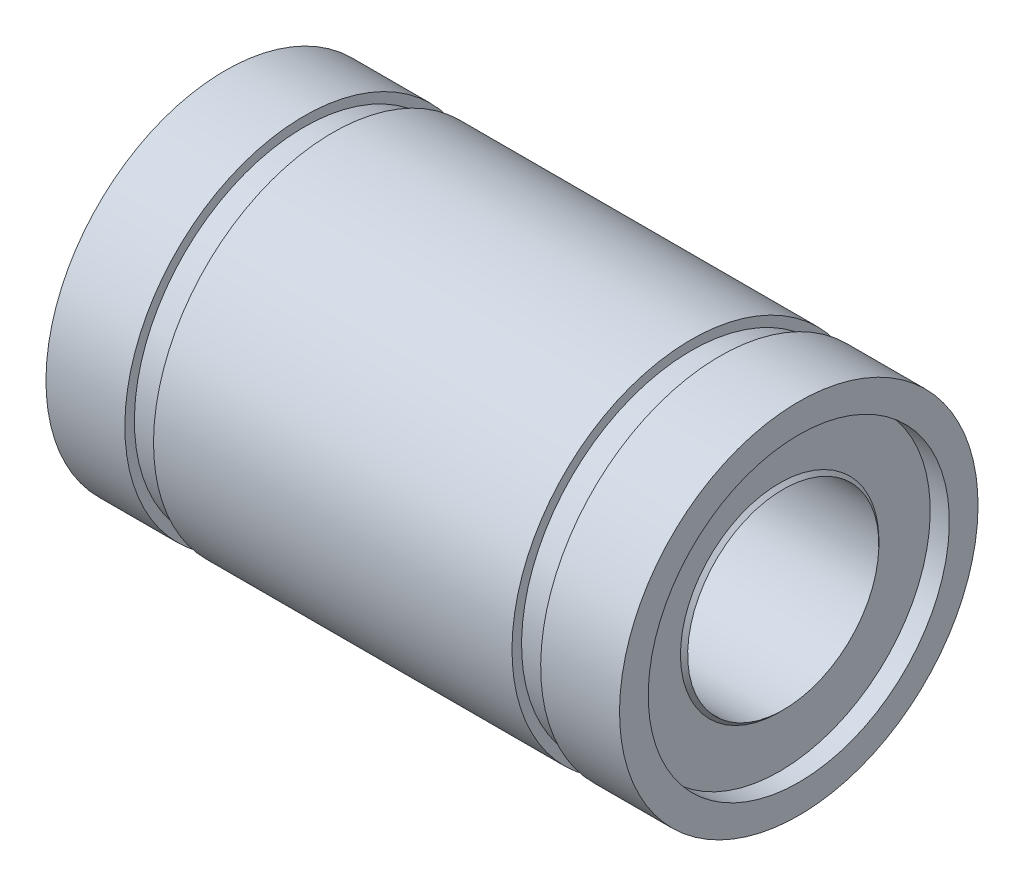
ISO-10303-21;
HEADER;
FILE_DESCRIPTION(('STEP AP214'),'2;1');
FILE_NAME('part.step','',(''),(''),'','','');
FILE_SCHEMA(('AUTOMOTIVE_DESIGN { 1 0 10303 214 1 1 1 1 }'));
ENDSEC;
DATA;
#1=APPLICATION_CONTEXT('core data for automotive mechanical design processes');
#2=APPLICATION_PROTOCOL_DEFINITION('international standard','automotive_design',2000,#1);
#3=PRODUCT_CONTEXT('',#1,'mechanical');
#4=PRODUCT('Part','Part','',(#3));
#5=PRODUCT_RELATED_PRODUCT_CATEGORY('part','',(#4));
#6=PRODUCT_DEFINITION_FORMATION('','',#4);
#7=PRODUCT_DEFINITION_CONTEXT('part definition',#1,'design');
#8=PRODUCT_DEFINITION('design','',#6,#7);
#9=PRODUCT_DEFINITION_SHAPE('','',#8);
#10=(LENGTH_UNIT() NAMED_UNIT(*) SI_UNIT(.MILLI.,.METRE.));
#11=(NAMED_UNIT(*) PLANE_ANGLE_UNIT() SI_UNIT($,.RADIAN.));
#12=(NAMED_UNIT(*) SI_UNIT($,.STERADIAN.) SOLID_ANGLE_UNIT());
#13=UNCERTAINTY_MEASURE_WITH_UNIT(LENGTH_MEASURE(1.E-05),#10,'distance_accuracy_value','');
#14=(GEOMETRIC_REPRESENTATION_CONTEXT(3) GLOBAL_UNCERTAINTY_ASSIGNED_CONTEXT((#13)) GLOBAL_UNIT_ASSIGNED_CONTEXT((#10,
#11,#12)) REPRESENTATION_CONTEXT('',''));
#15=CARTESIAN_POINT('',(0.,0.,0.));
#16=DIRECTION('',(0.,0.,1.));
#17=DIRECTION('',(1.,0.,0.));
#18=AXIS2_PLACEMENT_3D('',#15,#16,#17);
#19=CARTESIAN_POINT('',(-16.830555472771,-10.245239863841,5.674899117618));
#20=DIRECTION('',(1.,0.,0.));
#21=DIRECTION('',(0.,-0.982567445911182,-0.185906466362998));
#22=AXIS2_PLACEMENT_3D('',#19,#20,#21);
#23=CONICAL_SURFACE('',#22,4.075,0.785398163397448);
#24=CARTESIAN_POINT('',(-16.755555472771,-10.245239863841,5.674899117618));
#25=DIRECTION('',(1.,0.,0.));
#26=DIRECTION('',(0.,-0.185906466362998,0.982567445911182));
#27=AXIS2_PLACEMENT_3D('',#24,#25,#26);
#28=CIRCLE('',#27,4.15);
#29=CARTESIAN_POINT('',(-16.755555472771,-14.3228947643724,4.90338728221156));
#30=VERTEX_POINT('',#29);
#31=CARTESIAN_POINT('',(-16.755555472771,-6.16758496330959,6.44641095302444));
#32=VERTEX_POINT('',#31);
#33=EDGE_CURVE('E41',#30,#32,#28,.T.);
#34=ORIENTED_EDGE('',*,*,#33,.F.);
#35=CARTESIAN_POINT('',(-16.755555472771,-10.245239863841,5.674899117618));
#36=DIRECTION('',(1.,0.,0.));
#37=DIRECTION('',(0.,-0.185906466362998,0.982567445911182));
#38=AXIS2_PLACEMENT_3D('',#35,#36,#37);
#39=CIRCLE('',#38,4.15);
#40=EDGE_CURVE('E206',#32,#30,#39,.T.);
#41=ORIENTED_EDGE('',*,*,#40,.F.);
#42=DIRECTION('',(-0.707106781186547,-0.694780103976944,-0.131455723031705));
#43=VECTOR('',#42,1.);
#44=CARTESIAN_POINT('',(-16.830555472771,-6.24127752175293,6.43246796804722));
#45=LINE('',#44,#43);
#46=CARTESIAN_POINT('',(-16.905555472771,-6.31497008019627,6.41852498306999));
#47=VERTEX_POINT('',#46);
#48=EDGE_CURVE('E11',#32,#47,#45,.T.);
#49=ORIENTED_EDGE('',*,*,#48,.T.);
#50=CARTESIAN_POINT('',(-16.905555472771,-10.245239863841,5.674899117618));
#51=DIRECTION('',(1.,0.,0.));
#52=DIRECTION('',(0.,-0.185906466362998,0.982567445911182));
#53=AXIS2_PLACEMENT_3D('',#50,#51,#52);
#54=CIRCLE('',#53,4.);
#55=CARTESIAN_POINT('',(-16.905555472771,-14.1755096474857,4.93127325216601));
#56=VERTEX_POINT('',#55);
#57=EDGE_CURVE('E27',#47,#56,#54,.T.);
#58=ORIENTED_EDGE('',*,*,#57,.T.);
#59=CARTESIAN_POINT('',(-16.905555472771,-10.245239863841,5.674899117618));
#60=DIRECTION('',(1.,0.,0.));
#61=DIRECTION('',(0.,-0.185906466362998,0.982567445911182));
#62=AXIS2_PLACEMENT_3D('',#59,#60,#61);
#63=CIRCLE('',#62,4.);
#64=EDGE_CURVE('E205',#56,#47,#63,.T.);
#65=ORIENTED_EDGE('',*,*,#64,.T.);
#66=ORIENTED_EDGE('',*,*,#48,.F.);
#67=EDGE_LOOP('',(#34,#41,#49,#58,#65,#66));
#68=FACE_BOUND('',#67,.T.);
#69=ADVANCED_FACE('F16',(#68),#23,.T.);
#70=CARTESIAN_POINT('',(-16.755555472771,-16.4354147730814,4.50368837953111));
#71=DIRECTION('',(-1.,0.,0.));
#72=DIRECTION('',(0.,0.185906466362998,-0.982567445911182));
#73=AXIS2_PLACEMENT_3D('',#70,#71,#72);
#74=PLANE('',#73);
#75=CARTESIAN_POINT('',(-16.755555472771,-10.245239863841,5.674899117618));
#76=DIRECTION('',(1.,0.,0.));
#77=DIRECTION('',(0.,-0.185906466362998,0.982567445911182));
#78=AXIS2_PLACEMENT_3D('',#75,#76,#77);
#79=CIRCLE('',#78,6.3);
#80=CARTESIAN_POINT('',(-16.755555472771,-16.4354147730814,4.50368837953111));
#81=VERTEX_POINT('',#80);
#82=CARTESIAN_POINT('',(-16.755555472771,-4.05506495460056,6.84610985570489));
#83=VERTEX_POINT('',#82);
#84=EDGE_CURVE('E288',#81,#83,#79,.T.);
#85=ORIENTED_EDGE('',*,*,#84,.F.);
#86=CARTESIAN_POINT('',(-16.755555472771,-10.245239863841,5.674899117618));
#87=DIRECTION('',(1.,0.,0.));
#88=DIRECTION('',(0.,-0.185906466362998,0.982567445911182));
#89=AXIS2_PLACEMENT_3D('',#86,#87,#88);
#90=CIRCLE('',#89,6.3);
#91=EDGE_CURVE('E238',#83,#81,#90,.T.);
#92=ORIENTED_EDGE('',*,*,#91,.F.);
#93=EDGE_LOOP('',(#85,#92));
#94=FACE_BOUND('',#93,.T.);
#95=ORIENTED_EDGE('',*,*,#33,.T.);
#96=ORIENTED_EDGE('',*,*,#40,.T.);
#97=EDGE_LOOP('',(#95,#96));
#98=FACE_BOUND('',#97,.T.);
#99=ADVANCED_FACE('F366',(#94,#98),#74,.T.);
#100=CARTESIAN_POINT('',(-17.155555472771,-10.245239863841,5.674899117618));
#101=DIRECTION('',(1.,0.,0.));
#102=DIRECTION('',(0.,-0.982567445911182,-0.185906466362998));
#103=AXIS2_PLACEMENT_3D('',#100,#101,#102);
#104=CYLINDRICAL_SURFACE('',#103,6.3);
#105=ORIENTED_EDGE('',*,*,#84,.T.);
#106=DIRECTION('',(-1.,0.,0.));
#107=VECTOR('',#106,1.);
#108=CARTESIAN_POINT('',(-17.155555472771,-4.05506495460056,6.84610985570489));
#109=LINE('',#108,#107);
#110=CARTESIAN_POINT('',(-17.555555472771,-4.05506495460056,6.84610985570489));
#111=VERTEX_POINT('',#110);
#112=EDGE_CURVE('E242',#83,#111,#109,.T.);
#113=ORIENTED_EDGE('',*,*,#112,.T.);
#114=CARTESIAN_POINT('',(-17.555555472771,-10.245239863841,5.674899117618));
#115=DIRECTION('',(1.,0.,0.));
#116=DIRECTION('',(0.,-0.185906466362998,0.982567445911182));
#117=AXIS2_PLACEMENT_3D('',#114,#115,#116);
#118=CIRCLE('',#117,6.3);
#119=CARTESIAN_POINT('',(-17.555555472771,-16.4354147730814,4.50368837953111));
#120=VERTEX_POINT('',#119);
#121=EDGE_CURVE('E199',#120,#111,#118,.T.);
#122=ORIENTED_EDGE('',*,*,#121,.F.);
#123=CARTESIAN_POINT('',(-17.555555472771,-10.245239863841,5.674899117618));
#124=DIRECTION('',(1.,0.,0.));
#125=DIRECTION('',(0.,-0.185906466362998,0.982567445911182));
#126=AXIS2_PLACEMENT_3D('',#123,#124,#125);
#127=CIRCLE('',#126,6.3);
#128=EDGE_CURVE('E192',#111,#120,#127,.T.);
#129=ORIENTED_EDGE('',*,*,#128,.F.);
#130=ORIENTED_EDGE('',*,*,#112,.F.);
#131=ORIENTED_EDGE('',*,*,#91,.T.);
#132=EDGE_LOOP('',(#105,#113,#122,#129,#130,#131));
#133=FACE_BOUND('',#132,.T.);
#134=ADVANCED_FACE('F370',(#133),#104,.F.);
#135=CARTESIAN_POINT('',(-17.555555472771,-17.6144957081749,4.28060061989552));
#136=DIRECTION('',(-1.,0.,0.));
#137=DIRECTION('',(0.,0.185906466362998,-0.982567445911182));
#138=AXIS2_PLACEMENT_3D('',#135,#136,#137);
#139=PLANE('',#138);
#140=CARTESIAN_POINT('',(-17.555555472771,-10.245239863841,5.674899117618));
#141=DIRECTION('',(1.,0.,0.));
#142=DIRECTION('',(0.,-0.185906466362998,0.982567445911182));
#143=AXIS2_PLACEMENT_3D('',#140,#141,#142);
#144=CIRCLE('',#143,7.5);
#145=CARTESIAN_POINT('',(-17.555555472771,-17.6144957081749,4.28060061989552));
#146=VERTEX_POINT('',#145);
#147=CARTESIAN_POINT('',(-17.555555472771,-2.87598401950713,7.06919761534049));
#148=VERTEX_POINT('',#147);
#149=EDGE_CURVE('E20',#146,#148,#144,.T.);
#150=ORIENTED_EDGE('',*,*,#149,.F.);
#151=CARTESIAN_POINT('',(-17.555555472771,-10.245239863841,5.674899117618));
#152=DIRECTION('',(1.,0.,0.));
#153=DIRECTION('',(0.,-0.185906466362998,0.982567445911182));
#154=AXIS2_PLACEMENT_3D('',#151,#152,#153);
#155=CIRCLE('',#154,7.5);
#156=EDGE_CURVE('E180',#148,#146,#155,.T.);
#157=ORIENTED_EDGE('',*,*,#156,.F.);
#158=EDGE_LOOP('',(#150,#157));
#159=FACE_BOUND('',#158,.T.);
#160=ORIENTED_EDGE('',*,*,#121,.T.);
#161=ORIENTED_EDGE('',*,*,#128,.T.);
#162=EDGE_LOOP('',(#160,#161));
#163=FACE_BOUND('',#162,.T.);
#164=ADVANCED_FACE('F184',(#159,#163),#139,.T.);
#165=CARTESIAN_POINT('',(-15.905555472771,-10.245239863841,5.674899117618));
#166=DIRECTION('',(1.,0.,0.));
#167=DIRECTION('',(0.,-0.982567445911182,-0.185906466362998));
#168=AXIS2_PLACEMENT_3D('',#165,#166,#167);
#169=CYLINDRICAL_SURFACE('',#168,7.5);
#170=CARTESIAN_POINT('',(-14.255555472771,-10.245239863841,5.674899117618));
#171=DIRECTION('',(1.,0.,0.));
#172=DIRECTION('',(0.,-0.185906466362998,0.982567445911182));
#173=AXIS2_PLACEMENT_3D('',#170,#171,#172);
#174=CIRCLE('',#173,7.5);
#175=CARTESIAN_POINT('',(-14.255555472771,-17.6144957081749,4.28060061989552));
#176=VERTEX_POINT('',#175);
#177=CARTESIAN_POINT('',(-14.255555472771,-2.87598401950713,7.06919761534049));
#178=VERTEX_POINT('',#177);
#179=EDGE_CURVE('E183',#176,#178,#174,.T.);
#180=ORIENTED_EDGE('',*,*,#179,.F.);
#181=CARTESIAN_POINT('',(-14.255555472771,-10.245239863841,5.674899117618));
#182=DIRECTION('',(1.,0.,0.));
#183=DIRECTION('',(0.,-0.185906466362998,0.982567445911182));
#184=AXIS2_PLACEMENT_3D('',#181,#182,#183);
#185=CIRCLE('',#184,7.5);
#186=EDGE_CURVE('E189',#178,#176,#185,.T.);
#187=ORIENTED_EDGE('',*,*,#186,.F.);
#188=DIRECTION('',(-1.,0.,0.));
#189=VECTOR('',#188,1.);
#190=CARTESIAN_POINT('',(-15.905555472771,-2.87598401950713,7.06919761534049));
#191=LINE('',#190,#189);
#192=EDGE_CURVE('E179',#178,#148,#191,.T.);
#193=ORIENTED_EDGE('',*,*,#192,.T.);
#194=ORIENTED_EDGE('',*,*,#156,.T.);
#195=ORIENTED_EDGE('',*,*,#149,.T.);
#196=ORIENTED_EDGE('',*,*,#192,.F.);
#197=EDGE_LOOP('',(#180,#187,#193,#194,#195,#196));
#198=FACE_BOUND('',#197,.T.);
#199=ADVANCED_FACE('F177',(#198),#169,.T.);
#200=CARTESIAN_POINT('',(-14.255555472771,-17.2214687298104,4.35496320644071));
#201=DIRECTION('',(1.,0.,0.));
#202=DIRECTION('',(0.,-0.982567445911182,-0.185906466362998));
#203=AXIS2_PLACEMENT_3D('',#200,#201,#202);
#204=PLANE('',#203);
#205=ORIENTED_EDGE('',*,*,#179,.T.);
#206=ORIENTED_EDGE('',*,*,#186,.T.);
#207=EDGE_LOOP('',(#205,#206));
#208=FACE_BOUND('',#207,.T.);
#209=CARTESIAN_POINT('',(-14.255555472771,-10.245239863841,5.674899117618));
#210=DIRECTION('',(1.,0.,0.));
#211=DIRECTION('',(0.,-0.185906466362998,0.982567445911182));
#212=AXIS2_PLACEMENT_3D('',#209,#210,#211);
#213=CIRCLE('',#212,7.1);
#214=CARTESIAN_POINT('',(-14.255555472771,-17.2214687298104,4.35496320644071));
#215=VERTEX_POINT('',#214);
#216=CARTESIAN_POINT('',(-14.255555472771,-3.26901099787161,6.99483502879529));
#217=VERTEX_POINT('',#216);
#218=EDGE_CURVE('E229',#215,#217,#213,.T.);
#219=ORIENTED_EDGE('',*,*,#218,.F.);
#220=CARTESIAN_POINT('',(-14.255555472771,-10.245239863841,5.674899117618));
#221=DIRECTION('',(1.,0.,0.));
#222=DIRECTION('',(0.,-0.185906466362998,0.982567445911182));
#223=AXIS2_PLACEMENT_3D('',#220,#221,#222);
#224=CIRCLE('',#223,7.1);
#225=EDGE_CURVE('E231',#217,#215,#224,.T.);
#226=ORIENTED_EDGE('',*,*,#225,.F.);
#227=EDGE_LOOP('',(#219,#226));
#228=FACE_BOUND('',#227,.T.);
#229=ADVANCED_FACE('F352',(#208,#228),#204,.T.);
#230=CARTESIAN_POINT('',(-13.655555472771,-10.245239863841,5.674899117618));
#231=DIRECTION('',(1.,0.,0.));
#232=DIRECTION('',(0.,-0.982567445911182,-0.185906466362998));
#233=AXIS2_PLACEMENT_3D('',#230,#231,#232);
#234=CYLINDRICAL_SURFACE('',#233,7.1);
#235=CARTESIAN_POINT('',(-13.055555472771,-10.245239863841,5.674899117618));
#236=DIRECTION('',(1.,0.,0.));
#237=DIRECTION('',(0.,-0.185906466362998,0.982567445911182));
#238=AXIS2_PLACEMENT_3D('',#235,#236,#237);
#239=CIRCLE('',#238,7.1);
#240=CARTESIAN_POINT('',(-13.055555472771,-17.2214687298104,4.35496320644071));
#241=VERTEX_POINT('',#240);
#242=CARTESIAN_POINT('',(-13.055555472771,-3.26901099787161,6.99483502879529));
#243=VERTEX_POINT('',#242);
#244=EDGE_CURVE('E232',#241,#243,#239,.T.);
#245=ORIENTED_EDGE('',*,*,#244,.F.);
#246=CARTESIAN_POINT('',(-13.055555472771,-10.245239863841,5.674899117618));
#247=DIRECTION('',(1.,0.,0.));
#248=DIRECTION('',(0.,-0.185906466362998,0.982567445911182));
#249=AXIS2_PLACEMENT_3D('',#246,#247,#248);
#250=CIRCLE('',#249,7.1);
#251=EDGE_CURVE('E285',#243,#241,#250,.T.);
#252=ORIENTED_EDGE('',*,*,#251,.F.);
#253=DIRECTION('',(-1.,0.,0.));
#254=VECTOR('',#253,1.);
#255=CARTESIAN_POINT('',(-13.655555472771,-3.26901099787161,6.99483502879529));
#256=LINE('',#255,#254);
#257=EDGE_CURVE('E279',#243,#217,#256,.T.);
#258=ORIENTED_EDGE('',*,*,#257,.T.);
#259=ORIENTED_EDGE('',*,*,#225,.T.);
#260=ORIENTED_EDGE('',*,*,#218,.T.);
#261=ORIENTED_EDGE('',*,*,#257,.F.);
#262=EDGE_LOOP('',(#245,#252,#258,#259,#260,#261));
#263=FACE_BOUND('',#262,.T.);
#264=ADVANCED_FACE('F344',(#263),#234,.T.);
#265=CARTESIAN_POINT('',(-13.055555472771,-17.6144957081749,4.28060061989552));
#266=DIRECTION('',(-1.,0.,0.));
#267=DIRECTION('',(0.,0.185906466362998,-0.982567445911182));
#268=AXIS2_PLACEMENT_3D('',#265,#266,#267);
#269=PLANE('',#268);
#270=CARTESIAN_POINT('',(-13.055555472771,-10.245239863841,5.674899117618));
#271=DIRECTION('',(1.,0.,0.));
#272=DIRECTION('',(0.,-0.185906466362998,0.982567445911182));
#273=AXIS2_PLACEMENT_3D('',#270,#271,#272);
#274=CIRCLE('',#273,7.5);
#275=CARTESIAN_POINT('',(-13.055555472771,-17.6144957081749,4.28060061989552));
#276=VERTEX_POINT('',#275);
#277=CARTESIAN_POINT('',(-13.055555472771,-2.87598401950713,7.06919761534049));
#278=VERTEX_POINT('',#277);
#279=EDGE_CURVE('E271',#276,#278,#274,.T.);
#280=ORIENTED_EDGE('',*,*,#279,.F.);
#281=CARTESIAN_POINT('',(-13.055555472771,-10.245239863841,5.674899117618));
#282=DIRECTION('',(1.,0.,0.));
#283=DIRECTION('',(0.,-0.185906466362998,0.982567445911182));
#284=AXIS2_PLACEMENT_3D('',#281,#282,#283);
#285=CIRCLE('',#284,7.5);
#286=EDGE_CURVE('E274',#278,#276,#285,.T.);
#287=ORIENTED_EDGE('',*,*,#286,.F.);
#288=EDGE_LOOP('',(#280,#287));
#289=FACE_BOUND('',#288,.T.);
#290=ORIENTED_EDGE('',*,*,#244,.T.);
#291=ORIENTED_EDGE('',*,*,#251,.T.);
#292=EDGE_LOOP('',(#290,#291));
#293=FACE_BOUND('',#292,.T.);
#294=ADVANCED_FACE('F341',(#289,#293),#269,.T.);
#295=CARTESIAN_POINT('',(-5.555555472771,-10.245239863841,5.674899117618));
#296=DIRECTION('',(1.,0.,0.));
#297=DIRECTION('',(0.,-0.982567445911182,-0.185906466362998));
#298=AXIS2_PLACEMENT_3D('',#295,#296,#297);
#299=CYLINDRICAL_SURFACE('',#298,7.5);
#300=CARTESIAN_POINT('',(1.944444527229,-10.245239863841,5.674899117618));
#301=DIRECTION('',(1.,0.,0.));
#302=DIRECTION('',(0.,-0.185906466362998,0.982567445911182));
#303=AXIS2_PLACEMENT_3D('',#300,#301,#302);
#304=CIRCLE('',#303,7.5);
#305=CARTESIAN_POINT('',(1.944444527229,-17.6144957081749,4.28060061989552));
#306=VERTEX_POINT('',#305);
#307=CARTESIAN_POINT('',(1.944444527229,-2.87598401950711,7.06919761534049));
#308=VERTEX_POINT('',#307);
#309=EDGE_CURVE('E275',#306,#308,#304,.T.);
#310=ORIENTED_EDGE('',*,*,#309,.F.);
#311=CARTESIAN_POINT('',(1.944444527229,-10.245239863841,5.674899117618));
#312=DIRECTION('',(1.,0.,0.));
#313=DIRECTION('',(0.,-0.185906466362998,0.982567445911182));
#314=AXIS2_PLACEMENT_3D('',#311,#312,#313);
#315=CIRCLE('',#314,7.5);
#316=EDGE_CURVE('E297',#308,#306,#315,.T.);
#317=ORIENTED_EDGE('',*,*,#316,.F.);
#318=DIRECTION('',(-1.,0.,0.));
#319=VECTOR('',#318,1.);
#320=CARTESIAN_POINT('',(-5.55555547277101,-2.87598401950713,7.06919761534049));
#321=LINE('',#320,#319);
#322=EDGE_CURVE('E312',#308,#278,#321,.T.);
#323=ORIENTED_EDGE('',*,*,#322,.T.);
#324=ORIENTED_EDGE('',*,*,#286,.T.);
#325=ORIENTED_EDGE('',*,*,#279,.T.);
#326=ORIENTED_EDGE('',*,*,#322,.F.);
#327=EDGE_LOOP('',(#310,#317,#323,#324,#325,#326));
#328=FACE_BOUND('',#327,.T.);
#329=ADVANCED_FACE('F338',(#328),#299,.T.);
#330=CARTESIAN_POINT('',(1.944444527229,-17.2214687298104,4.35496320644071));
#331=DIRECTION('',(1.,0.,0.));
#332=DIRECTION('',(0.,-0.982567445911182,-0.185906466362998));
#333=AXIS2_PLACEMENT_3D('',#330,#331,#332);
#334=PLANE('',#333);
#335=ORIENTED_EDGE('',*,*,#309,.T.);
#336=ORIENTED_EDGE('',*,*,#316,.T.);
#337=EDGE_LOOP('',(#335,#336));
#338=FACE_BOUND('',#337,.T.);
#339=CARTESIAN_POINT('',(1.944444527229,-10.245239863841,5.674899117618));
#340=DIRECTION('',(1.,0.,0.));
#341=DIRECTION('',(0.,-0.185906466362998,0.982567445911182));
#342=AXIS2_PLACEMENT_3D('',#339,#340,#341);
#343=CIRCLE('',#342,7.1);
#344=CARTESIAN_POINT('',(1.944444527229,-17.2214687298104,4.35496320644071));
#345=VERTEX_POINT('',#344);
#346=CARTESIAN_POINT('',(1.944444527229,-3.26901099787159,6.99483502879529));
#347=VERTEX_POINT('',#346);
#348=EDGE_CURVE('E226',#345,#347,#343,.T.);
#349=ORIENTED_EDGE('',*,*,#348,.F.);
#350=CARTESIAN_POINT('',(1.944444527229,-10.245239863841,5.674899117618));
#351=DIRECTION('',(1.,0.,0.));
#352=DIRECTION('',(0.,-0.185906466362998,0.982567445911182));
#353=AXIS2_PLACEMENT_3D('',#350,#351,#352);
#354=CIRCLE('',#353,7.1);
#355=EDGE_CURVE('E221',#347,#345,#354,.T.);
#356=ORIENTED_EDGE('',*,*,#355,.F.);
#357=EDGE_LOOP('',(#349,#356));
#358=FACE_BOUND('',#357,.T.);
#359=ADVANCED_FACE('F382',(#338,#358),#334,.T.);
#360=CARTESIAN_POINT('',(2.544444527229,-10.245239863841,5.674899117618));
#361=DIRECTION('',(1.,0.,0.));
#362=DIRECTION('',(0.,-0.982567445911182,-0.185906466362998));
#363=AXIS2_PLACEMENT_3D('',#360,#361,#362);
#364=CYLINDRICAL_SURFACE('',#363,7.1);
#365=CARTESIAN_POINT('',(3.144444527229,-10.245239863841,5.674899117618));
#366=DIRECTION('',(1.,0.,0.));
#367=DIRECTION('',(0.,-0.185906466362998,0.982567445911182));
#368=AXIS2_PLACEMENT_3D('',#365,#366,#367);
#369=CIRCLE('',#368,7.1);
#370=CARTESIAN_POINT('',(3.144444527229,-17.2214687298104,4.35496320644071));
#371=VERTEX_POINT('',#370);
#372=CARTESIAN_POINT('',(3.144444527229,-3.26901099787159,6.99483502879529));
#373=VERTEX_POINT('',#372);
#374=EDGE_CURVE('E234',#371,#373,#369,.T.);
#375=ORIENTED_EDGE('',*,*,#374,.F.);
#376=CARTESIAN_POINT('',(3.144444527229,-10.245239863841,5.674899117618));
#377=DIRECTION('',(1.,0.,0.));
#378=DIRECTION('',(0.,-0.185906466362998,0.982567445911182));
#379=AXIS2_PLACEMENT_3D('',#376,#377,#378);
#380=CIRCLE('',#379,7.1);
#381=EDGE_CURVE('E213',#373,#371,#380,.T.);
#382=ORIENTED_EDGE('',*,*,#381,.F.);
#383=DIRECTION('',(-1.,0.,0.));
#384=VECTOR('',#383,1.);
#385=CARTESIAN_POINT('',(2.544444527229,-3.26901099787159,6.99483502879529));
#386=LINE('',#385,#384);
#387=EDGE_CURVE('E225',#373,#347,#386,.T.);
#388=ORIENTED_EDGE('',*,*,#387,.T.);
#389=ORIENTED_EDGE('',*,*,#355,.T.);
#390=ORIENTED_EDGE('',*,*,#348,.T.);
#391=ORIENTED_EDGE('',*,*,#387,.F.);
#392=EDGE_LOOP('',(#375,#382,#388,#389,#390,#391));
#393=FACE_BOUND('',#392,.T.);
#394=ADVANCED_FACE('F386',(#393),#364,.T.);
#395=CARTESIAN_POINT('',(3.144444527229,-17.6144957081749,4.28060061989552));
#396=DIRECTION('',(-1.,0.,0.));
#397=DIRECTION('',(0.,0.185906466362998,-0.982567445911182));
#398=AXIS2_PLACEMENT_3D('',#395,#396,#397);
#399=PLANE('',#398);
#400=CARTESIAN_POINT('',(3.144444527229,-10.245239863841,5.674899117618));
#401=DIRECTION('',(1.,0.,0.));
#402=DIRECTION('',(0.,-0.185906466362998,0.982567445911182));
#403=AXIS2_PLACEMENT_3D('',#400,#401,#402);
#404=CIRCLE('',#403,7.5);
#405=CARTESIAN_POINT('',(3.144444527229,-17.6144957081749,4.28060061989552));
#406=VERTEX_POINT('',#405);
#407=CARTESIAN_POINT('',(3.144444527229,-2.87598401950711,7.06919761534049));
#408=VERTEX_POINT('',#407);
#409=EDGE_CURVE('E269',#406,#408,#404,.T.);
#410=ORIENTED_EDGE('',*,*,#409,.F.);
#411=CARTESIAN_POINT('',(3.144444527229,-10.245239863841,5.674899117618));
#412=DIRECTION('',(1.,0.,0.));
#413=DIRECTION('',(0.,-0.185906466362998,0.982567445911182));
#414=AXIS2_PLACEMENT_3D('',#411,#412,#413);
#415=CIRCLE('',#414,7.5);
#416=EDGE_CURVE('E214',#408,#406,#415,.T.);
#417=ORIENTED_EDGE('',*,*,#416,.F.);
#418=EDGE_LOOP('',(#410,#417));
#419=FACE_BOUND('',#418,.T.);
#420=ORIENTED_EDGE('',*,*,#374,.T.);
#421=ORIENTED_EDGE('',*,*,#381,.T.);
#422=EDGE_LOOP('',(#420,#421));
#423=FACE_BOUND('',#422,.T.);
#424=ADVANCED_FACE('F388',(#419,#423),#399,.T.);
#425=CARTESIAN_POINT('',(4.794444527229,-10.245239863841,5.674899117618));
#426=DIRECTION('',(1.,0.,0.));
#427=DIRECTION('',(0.,-0.982567445911182,-0.185906466362998));
#428=AXIS2_PLACEMENT_3D('',#425,#426,#427);
#429=CYLINDRICAL_SURFACE('',#428,7.5);
#430=CARTESIAN_POINT('',(6.444444527229,-10.245239863841,5.674899117618));
#431=DIRECTION('',(1.,0.,0.));
#432=DIRECTION('',(0.,-0.185906466362998,0.982567445911182));
#433=AXIS2_PLACEMENT_3D('',#430,#431,#432);
#434=CIRCLE('',#433,7.5);
#435=CARTESIAN_POINT('',(6.44444452722901,-17.6144957081749,4.28060061989552));
#436=VERTEX_POINT('',#435);
#437=CARTESIAN_POINT('',(6.44444452722899,-2.87598401950711,7.06919761534049));
#438=VERTEX_POINT('',#437);
#439=EDGE_CURVE('E265',#436,#438,#434,.T.);
#440=ORIENTED_EDGE('',*,*,#439,.F.);
#441=CARTESIAN_POINT('',(6.444444527229,-10.245239863841,5.674899117618));
#442=DIRECTION('',(1.,0.,0.));
#443=DIRECTION('',(0.,-0.185906466362998,0.982567445911182));
#444=AXIS2_PLACEMENT_3D('',#441,#442,#443);
#445=CIRCLE('',#444,7.5);
#446=EDGE_CURVE('E270',#438,#436,#445,.T.);
#447=ORIENTED_EDGE('',*,*,#446,.F.);
#448=DIRECTION('',(-1.,0.,0.));
#449=VECTOR('',#448,1.);
#450=CARTESIAN_POINT('',(4.79444452722899,-2.87598401950711,7.06919761534049));
#451=LINE('',#450,#449);
#452=EDGE_CURVE('E209',#438,#408,#451,.T.);
#453=ORIENTED_EDGE('',*,*,#452,.T.);
#454=ORIENTED_EDGE('',*,*,#416,.T.);
#455=ORIENTED_EDGE('',*,*,#409,.T.);
#456=ORIENTED_EDGE('',*,*,#452,.F.);
#457=EDGE_LOOP('',(#440,#447,#453,#454,#455,#456));
#458=FACE_BOUND('',#457,.T.);
#459=ADVANCED_FACE('F400',(#458),#429,.T.);
#460=CARTESIAN_POINT('',(6.44444452722901,-16.4354147730814,4.50368837953111));
#461=DIRECTION('',(1.,0.,0.));
#462=DIRECTION('',(0.,-0.982567445911182,-0.185906466362998));
#463=AXIS2_PLACEMENT_3D('',#460,#461,#462);
#464=PLANE('',#463);
#465=ORIENTED_EDGE('',*,*,#439,.T.);
#466=ORIENTED_EDGE('',*,*,#446,.T.);
#467=EDGE_LOOP('',(#465,#466));
#468=FACE_BOUND('',#467,.T.);
#469=CARTESIAN_POINT('',(6.444444527229,-10.245239863841,5.674899117618));
#470=DIRECTION('',(1.,0.,0.));
#471=DIRECTION('',(0.,-0.185906466362998,0.982567445911182));
#472=AXIS2_PLACEMENT_3D('',#469,#470,#471);
#473=CIRCLE('',#472,6.3);
#474=CARTESIAN_POINT('',(6.44444452722901,-16.4354147730814,4.50368837953111));
#475=VERTEX_POINT('',#474);
#476=CARTESIAN_POINT('',(6.44444452722899,-4.05506495460053,6.84610985570489));
#477=VERTEX_POINT('',#476);
#478=EDGE_CURVE('E302',#475,#477,#473,.T.);
#479=ORIENTED_EDGE('',*,*,#478,.F.);
#480=CARTESIAN_POINT('',(6.444444527229,-10.245239863841,5.674899117618));
#481=DIRECTION('',(1.,0.,0.));
#482=DIRECTION('',(0.,-0.185906466362998,0.982567445911182));
#483=AXIS2_PLACEMENT_3D('',#480,#481,#482);
#484=CIRCLE('',#483,6.3);
#485=EDGE_CURVE('E303',#477,#475,#484,.T.);
#486=ORIENTED_EDGE('',*,*,#485,.F.);
#487=EDGE_LOOP('',(#479,#486));
#488=FACE_BOUND('',#487,.T.);
#489=ADVANCED_FACE('F405',(#468,#488),#464,.T.);
#490=CARTESIAN_POINT('',(6.044444527229,-10.245239863841,5.674899117618));
#491=DIRECTION('',(1.,0.,0.));
#492=DIRECTION('',(0.,-0.982567445911182,-0.185906466362998));
#493=AXIS2_PLACEMENT_3D('',#490,#491,#492);
#494=CYLINDRICAL_SURFACE('',#493,6.3);
#495=ORIENTED_EDGE('',*,*,#478,.T.);
#496=DIRECTION('',(-1.,0.,0.));
#497=VECTOR('',#496,1.);
#498=CARTESIAN_POINT('',(6.04444452722899,-4.05506495460053,6.84610985570489));
#499=LINE('',#498,#497);
#500=CARTESIAN_POINT('',(5.64444452722899,-4.05506495460053,6.84610985570489));
#501=VERTEX_POINT('',#500);
#502=EDGE_CURVE('E298',#477,#501,#499,.T.);
#503=ORIENTED_EDGE('',*,*,#502,.T.);
#504=CARTESIAN_POINT('',(5.644444527229,-10.245239863841,5.674899117618));
#505=DIRECTION('',(1.,0.,0.));
#506=DIRECTION('',(0.,-0.185906466362998,0.982567445911182));
#507=AXIS2_PLACEMENT_3D('',#504,#505,#506);
#508=CIRCLE('',#507,6.3);
#509=CARTESIAN_POINT('',(5.64444452722901,-16.4354147730814,4.50368837953111));
#510=VERTEX_POINT('',#509);
#511=EDGE_CURVE('E246',#510,#501,#508,.T.);
#512=ORIENTED_EDGE('',*,*,#511,.F.);
#513=CARTESIAN_POINT('',(5.644444527229,-10.245239863841,5.674899117618));
#514=DIRECTION('',(1.,0.,0.));
#515=DIRECTION('',(0.,-0.185906466362998,0.982567445911182));
#516=AXIS2_PLACEMENT_3D('',#513,#514,#515);
#517=CIRCLE('',#516,6.3);
#518=EDGE_CURVE('E219',#501,#510,#517,.T.);
#519=ORIENTED_EDGE('',*,*,#518,.F.);
#520=ORIENTED_EDGE('',*,*,#502,.F.);
#521=ORIENTED_EDGE('',*,*,#485,.T.);
#522=EDGE_LOOP('',(#495,#503,#512,#519,#520,#521));
#523=FACE_BOUND('',#522,.T.);
#524=ADVANCED_FACE('F396',(#523),#494,.F.);
#525=CARTESIAN_POINT('',(5.644444527229,-14.3228947643724,4.90338728221156));
#526=DIRECTION('',(1.,0.,0.));
#527=DIRECTION('',(0.,-0.982567445911182,-0.185906466362998));
#528=AXIS2_PLACEMENT_3D('',#525,#526,#527);
#529=PLANE('',#528);
#530=ORIENTED_EDGE('',*,*,#511,.T.);
#531=ORIENTED_EDGE('',*,*,#518,.T.);
#532=EDGE_LOOP('',(#530,#531));
#533=FACE_BOUND('',#532,.T.);
#534=CARTESIAN_POINT('',(5.644444527229,-10.245239863841,5.674899117618));
#535=DIRECTION('',(1.,0.,0.));
#536=DIRECTION('',(0.,-0.185906466362998,0.982567445911182));
#537=AXIS2_PLACEMENT_3D('',#534,#535,#536);
#538=CIRCLE('',#537,4.15);
#539=CARTESIAN_POINT('',(5.644444527229,-14.3228947643724,4.90338728221156));
#540=VERTEX_POINT('',#539);
#541=CARTESIAN_POINT('',(5.644444527229,-6.16758496330957,6.44641095302444));
#542=VERTEX_POINT('',#541);
#543=EDGE_CURVE('E247',#540,#542,#538,.T.);
#544=ORIENTED_EDGE('',*,*,#543,.F.);
#545=CARTESIAN_POINT('',(5.644444527229,-10.245239863841,5.674899117618));
#546=DIRECTION('',(1.,0.,0.));
#547=DIRECTION('',(0.,-0.185906466362998,0.982567445911182));
#548=AXIS2_PLACEMENT_3D('',#545,#546,#547);
#549=CIRCLE('',#548,4.15);
#550=EDGE_CURVE('E220',#542,#540,#549,.T.);
#551=ORIENTED_EDGE('',*,*,#550,.F.);
#552=EDGE_LOOP('',(#544,#551));
#553=FACE_BOUND('',#552,.T.);
#554=ADVANCED_FACE('F394',(#533,#553),#529,.T.);
#555=CARTESIAN_POINT('',(5.719444527229,-10.245239863841,5.674899117618));
#556=DIRECTION('',(-1.,0.,0.));
#557=DIRECTION('',(0.,-0.982567445911182,-0.185906466362998));
#558=AXIS2_PLACEMENT_3D('',#555,#556,#557);
#559=CONICAL_SURFACE('',#558,4.075,0.785398163397448);
#560=CARTESIAN_POINT('',(5.794444527229,-10.245239863841,5.674899117618));
#561=DIRECTION('',(1.,0.,0.));
#562=DIRECTION('',(0.,-0.185906466362998,0.982567445911182));
#563=AXIS2_PLACEMENT_3D('',#560,#561,#562);
#564=CIRCLE('',#563,4.);
#565=CARTESIAN_POINT('',(5.794444527229,-14.1755096474857,4.93127325216601));
#566=VERTEX_POINT('',#565);
#567=CARTESIAN_POINT('',(5.794444527229,-6.31497008019625,6.41852498306999));
#568=VERTEX_POINT('',#567);
#569=EDGE_CURVE('E249',#566,#568,#564,.T.);
#570=ORIENTED_EDGE('',*,*,#569,.F.);
#571=CARTESIAN_POINT('',(5.794444527229,-10.245239863841,5.674899117618));
#572=DIRECTION('',(1.,0.,0.));
#573=DIRECTION('',(0.,-0.185906466362998,0.982567445911182));
#574=AXIS2_PLACEMENT_3D('',#571,#572,#573);
#575=CIRCLE('',#574,4.);
#576=EDGE_CURVE('E257',#568,#566,#575,.T.);
#577=ORIENTED_EDGE('',*,*,#576,.F.);
#578=DIRECTION('',(-0.707106781186549,0.694780103976943,0.131455723031705));
#579=VECTOR('',#578,1.);
#580=CARTESIAN_POINT('',(5.719444527229,-6.24127752175291,6.43246796804722));
#581=LINE('',#580,#579);
#582=EDGE_CURVE('E215',#568,#542,#581,.T.);
#583=ORIENTED_EDGE('',*,*,#582,.T.);
#584=ORIENTED_EDGE('',*,*,#550,.T.);
#585=ORIENTED_EDGE('',*,*,#543,.T.);
#586=ORIENTED_EDGE('',*,*,#582,.F.);
#587=EDGE_LOOP('',(#570,#577,#583,#584,#585,#586));
#588=FACE_BOUND('',#587,.T.);
#589=ADVANCED_FACE('F18',(#588),#559,.T.);
#590=CARTESIAN_POINT('',(-5.555555472771,-10.245239863841,5.674899117618));
#591=DIRECTION('',(1.,0.,0.));
#592=DIRECTION('',(0.,-0.982567445911182,-0.185906466362998));
#593=AXIS2_PLACEMENT_3D('',#590,#591,#592);
#594=CYLINDRICAL_SURFACE('',#593,4.);
#595=ORIENTED_EDGE('',*,*,#569,.T.);
#596=DIRECTION('',(-1.,0.,0.));
#597=VECTOR('',#596,1.);
#598=CARTESIAN_POINT('',(-5.555555472771,-6.31497008019626,6.41852498306999));
#599=LINE('',#598,#597);
#600=EDGE_CURVE('E261',#568,#47,#599,.T.);
#601=ORIENTED_EDGE('',*,*,#600,.T.);
#602=ORIENTED_EDGE('',*,*,#64,.F.);
#603=ORIENTED_EDGE('',*,*,#57,.F.);
#604=ORIENTED_EDGE('',*,*,#600,.F.);
#605=ORIENTED_EDGE('',*,*,#576,.T.);
#606=EDGE_LOOP('',(#595,#601,#602,#603,#604,#605));
#607=FACE_BOUND('',#606,.T.);
#608=ADVANCED_FACE('F377',(#607),#594,.F.);
#609=CLOSED_SHELL('',(#69,#99,#134,#164,#199,#229,#264,#294,#329,#359,#394,#424,#459,#489,#524,
#554,#589,#608));
#610=MANIFOLD_SOLID_BREP('B1',#609);
#611=ADVANCED_BREP_SHAPE_REPRESENTATION('',(#18,#610),#14);
#612=SHAPE_DEFINITION_REPRESENTATION(#9,#611);
ENDSEC;
END-ISO-10303-21;
